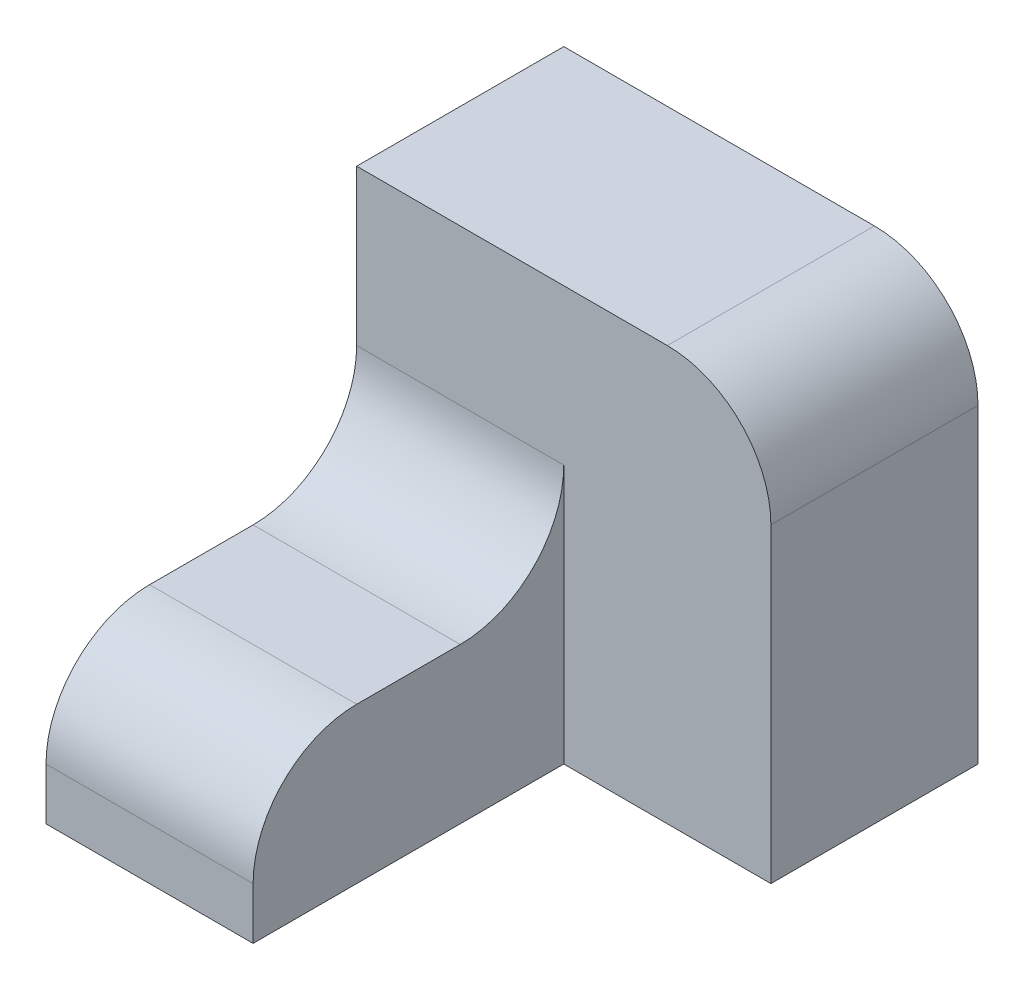
ISO-10303-21;
HEADER;
FILE_DESCRIPTION(('STEP AP214'),'2;1');
FILE_NAME('part.step','',(''),(''),'','','');
FILE_SCHEMA(('AUTOMOTIVE_DESIGN { 1 0 10303 214 1 1 1 1 }'));
ENDSEC;
DATA;
#1=APPLICATION_CONTEXT('core data for automotive mechanical design processes');
#2=APPLICATION_PROTOCOL_DEFINITION('international standard','automotive_design',2000,#1);
#3=PRODUCT_CONTEXT('',#1,'mechanical');
#4=PRODUCT('Part','Part','',(#3));
#5=PRODUCT_RELATED_PRODUCT_CATEGORY('part','',(#4));
#6=PRODUCT_DEFINITION_FORMATION('','',#4);
#7=PRODUCT_DEFINITION_CONTEXT('part definition',#1,'design');
#8=PRODUCT_DEFINITION('design','',#6,#7);
#9=PRODUCT_DEFINITION_SHAPE('','',#8);
#10=(LENGTH_UNIT() NAMED_UNIT(*) SI_UNIT(.MILLI.,.METRE.));
#11=(NAMED_UNIT(*) PLANE_ANGLE_UNIT() SI_UNIT($,.RADIAN.));
#12=(NAMED_UNIT(*) SI_UNIT($,.STERADIAN.) SOLID_ANGLE_UNIT());
#13=UNCERTAINTY_MEASURE_WITH_UNIT(LENGTH_MEASURE(1.E-05),#10,'distance_accuracy_value','');
#14=(GEOMETRIC_REPRESENTATION_CONTEXT(3) GLOBAL_UNCERTAINTY_ASSIGNED_CONTEXT((#13)) GLOBAL_UNIT_ASSIGNED_CONTEXT((#10,
#11,#12)) REPRESENTATION_CONTEXT('',''));
#15=CARTESIAN_POINT('',(0.,0.,0.));
#16=DIRECTION('',(0.,0.,1.));
#17=DIRECTION('',(1.,0.,0.));
#18=AXIS2_PLACEMENT_3D('',#15,#16,#17);
#19=CARTESIAN_POINT('',(-10.,0.,30.));
#20=DIRECTION('',(0.,-1.,0.));
#21=DIRECTION('',(1.,0.,0.));
#22=AXIS2_PLACEMENT_3D('',#19,#20,#21);
#23=PLANE('',#22);
#24=DIRECTION('',(0.,0.,-1.));
#25=VECTOR('',#24,1.);
#26=CARTESIAN_POINT('',(-10.,0.,30.));
#27=LINE('',#26,#25);
#28=CARTESIAN_POINT('',(-10.,0.,20.));
#29=VERTEX_POINT('',#28);
#30=CARTESIAN_POINT('',(-10.,0.,10.));
#31=VERTEX_POINT('',#30);
#32=EDGE_CURVE('E164',#29,#31,#27,.T.);
#33=ORIENTED_EDGE('',*,*,#32,.T.);
#34=DIRECTION('',(-1.,0.,0.));
#35=VECTOR('',#34,1.);
#36=CARTESIAN_POINT('',(-10.,0.,10.));
#37=LINE('',#36,#35);
#38=CARTESIAN_POINT('',(-30.,0.,10.));
#39=VERTEX_POINT('',#38);
#40=EDGE_CURVE('E178',#31,#39,#37,.T.);
#41=ORIENTED_EDGE('',*,*,#40,.T.);
#42=DIRECTION('',(0.,0.,-1.));
#43=VECTOR('',#42,1.);
#44=CARTESIAN_POINT('',(-30.,0.,30.));
#45=LINE('',#44,#43);
#46=CARTESIAN_POINT('',(-30.,0.,20.));
#47=VERTEX_POINT('',#46);
#48=EDGE_CURVE('E173',#47,#39,#45,.T.);
#49=ORIENTED_EDGE('',*,*,#48,.F.);
#50=DIRECTION('',(-1.,0.,0.));
#51=VECTOR('',#50,1.);
#52=CARTESIAN_POINT('',(-10.,0.,20.));
#53=LINE('',#52,#51);
#54=EDGE_CURVE('E176',#47,#29,#53,.F.);
#55=ORIENTED_EDGE('',*,*,#54,.T.);
#56=EDGE_LOOP('',(#33,#41,#49,#55));
#57=FACE_BOUND('',#56,.T.);
#58=ADVANCED_FACE('F35',(#57),#23,.F.);
#59=CARTESIAN_POINT('',(-30.,0.,30.));
#60=DIRECTION('',(1.,0.,0.));
#61=DIRECTION('',(0.,0.,-1.));
#62=AXIS2_PLACEMENT_3D('',#59,#60,#61);
#63=PLANE('',#62);
#64=DIRECTION('',(0.,-1.,0.));
#65=VECTOR('',#64,1.);
#66=CARTESIAN_POINT('',(-30.,0.,30.));
#67=LINE('',#66,#65);
#68=CARTESIAN_POINT('',(-30.,-10.,30.));
#69=VERTEX_POINT('',#68);
#70=CARTESIAN_POINT('',(-30.,-15.,30.));
#71=VERTEX_POINT('',#70);
#72=EDGE_CURVE('E158',#69,#71,#67,.T.);
#73=ORIENTED_EDGE('',*,*,#72,.F.);
#74=CARTESIAN_POINT('',(-30.,-10.,20.));
#75=DIRECTION('',(1.,0.,0.));
#76=DIRECTION('',(0.,0.,-1.));
#77=AXIS2_PLACEMENT_3D('',#74,#75,#76);
#78=CIRCLE('',#77,10.);
#79=EDGE_CURVE('E58',#69,#47,#78,.F.);
#80=ORIENTED_EDGE('',*,*,#79,.T.);
#81=ORIENTED_EDGE('',*,*,#48,.T.);
#82=CARTESIAN_POINT('',(-30.,10.,10.));
#83=DIRECTION('',(1.,0.,0.));
#84=DIRECTION('',(0.,0.,-1.));
#85=AXIS2_PLACEMENT_3D('',#82,#83,#84);
#86=CIRCLE('',#85,10.);
#87=CARTESIAN_POINT('',(-30.,10.,0.));
#88=VERTEX_POINT('',#87);
#89=EDGE_CURVE('E43',#39,#88,#86,.T.);
#90=ORIENTED_EDGE('',*,*,#89,.T.);
#91=DIRECTION('',(0.,-1.,0.));
#92=VECTOR('',#91,1.);
#93=CARTESIAN_POINT('',(-30.,25.,0.));
#94=LINE('',#93,#92);
#95=CARTESIAN_POINT('',(-30.,25.,0.));
#96=VERTEX_POINT('',#95);
#97=EDGE_CURVE('E134',#96,#88,#94,.T.);
#98=ORIENTED_EDGE('',*,*,#97,.F.);
#99=DIRECTION('',(0.,0.,1.));
#100=VECTOR('',#99,1.);
#101=CARTESIAN_POINT('',(-30.,25.,-20.));
#102=LINE('',#101,#100);
#103=CARTESIAN_POINT('',(-30.,25.,-20.));
#104=VERTEX_POINT('',#103);
#105=EDGE_CURVE('E118',#104,#96,#102,.T.);
#106=ORIENTED_EDGE('',*,*,#105,.F.);
#107=DIRECTION('',(0.,-1.,0.));
#108=VECTOR('',#107,1.);
#109=CARTESIAN_POINT('',(-30.,25.,-20.));
#110=LINE('',#109,#108);
#111=CARTESIAN_POINT('',(-30.,-15.,-20.));
#112=VERTEX_POINT('',#111);
#113=EDGE_CURVE('E125',#104,#112,#110,.T.);
#114=ORIENTED_EDGE('',*,*,#113,.T.);
#115=DIRECTION('',(0.,0.,-1.));
#116=VECTOR('',#115,1.);
#117=CARTESIAN_POINT('',(-30.,-15.,30.));
#118=LINE('',#117,#116);
#119=EDGE_CURVE('E171',#71,#112,#118,.T.);
#120=ORIENTED_EDGE('',*,*,#119,.F.);
#121=EDGE_LOOP('',(#73,#80,#81,#90,#98,#106,#114,#120));
#122=FACE_BOUND('',#121,.T.);
#123=ADVANCED_FACE('F131',(#122),#63,.F.);
#124=CARTESIAN_POINT('',(-30.,-15.,30.));
#125=DIRECTION('',(0.,1.,0.));
#126=DIRECTION('',(0.,0.,1.));
#127=AXIS2_PLACEMENT_3D('',#124,#125,#126);
#128=PLANE('',#127);
#129=ORIENTED_EDGE('',*,*,#119,.T.);
#130=DIRECTION('',(1.,0.,0.));
#131=VECTOR('',#130,1.);
#132=CARTESIAN_POINT('',(-30.,-15.,-20.));
#133=LINE('',#132,#131);
#134=CARTESIAN_POINT('',(10.,-15.,-20.));
#135=VERTEX_POINT('',#134);
#136=EDGE_CURVE('E142',#112,#135,#133,.T.);
#137=ORIENTED_EDGE('',*,*,#136,.T.);
#138=DIRECTION('',(0.,0.,1.));
#139=VECTOR('',#138,1.);
#140=CARTESIAN_POINT('',(10.,-15.,-20.));
#141=LINE('',#140,#139);
#142=CARTESIAN_POINT('',(10.,-15.,0.));
#143=VERTEX_POINT('',#142);
#144=EDGE_CURVE('E135',#135,#143,#141,.T.);
#145=ORIENTED_EDGE('',*,*,#144,.T.);
#146=DIRECTION('',(1.,0.,0.));
#147=VECTOR('',#146,1.);
#148=CARTESIAN_POINT('',(-30.,-15.,0.));
#149=LINE('',#148,#147);
#150=CARTESIAN_POINT('',(-10.,-15.,0.));
#151=VERTEX_POINT('',#150);
#152=EDGE_CURVE('E151',#151,#143,#149,.T.);
#153=ORIENTED_EDGE('',*,*,#152,.F.);
#154=DIRECTION('',(0.,0.,-1.));
#155=VECTOR('',#154,1.);
#156=CARTESIAN_POINT('',(-10.,-15.,30.));
#157=LINE('',#156,#155);
#158=CARTESIAN_POINT('',(-10.,-15.,30.));
#159=VERTEX_POINT('',#158);
#160=EDGE_CURVE('E168',#159,#151,#157,.T.);
#161=ORIENTED_EDGE('',*,*,#160,.F.);
#162=DIRECTION('',(1.,0.,0.));
#163=VECTOR('',#162,1.);
#164=CARTESIAN_POINT('',(-30.,-15.,30.));
#165=LINE('',#164,#163);
#166=EDGE_CURVE('E160',#71,#159,#165,.T.);
#167=ORIENTED_EDGE('',*,*,#166,.F.);
#168=EDGE_LOOP('',(#129,#137,#145,#153,#161,#167));
#169=FACE_BOUND('',#168,.T.);
#170=ADVANCED_FACE('F210',(#169),#128,.F.);
#171=CARTESIAN_POINT('',(-10.,-15.,30.));
#172=DIRECTION('',(-1.,0.,0.));
#173=DIRECTION('',(0.,0.,1.));
#174=AXIS2_PLACEMENT_3D('',#171,#172,#173);
#175=PLANE('',#174);
#176=ORIENTED_EDGE('',*,*,#32,.F.);
#177=CARTESIAN_POINT('',(-10.,-10.,20.));
#178=DIRECTION('',(-1.,0.,0.));
#179=DIRECTION('',(0.,0.,1.));
#180=AXIS2_PLACEMENT_3D('',#177,#178,#179);
#181=CIRCLE('',#180,10.);
#182=CARTESIAN_POINT('',(-10.,-10.,30.));
#183=VERTEX_POINT('',#182);
#184=EDGE_CURVE('E50',#29,#183,#181,.F.);
#185=ORIENTED_EDGE('',*,*,#184,.T.);
#186=DIRECTION('',(0.,1.,0.));
#187=VECTOR('',#186,1.);
#188=CARTESIAN_POINT('',(-10.,-15.,30.));
#189=LINE('',#188,#187);
#190=EDGE_CURVE('E162',#159,#183,#189,.T.);
#191=ORIENTED_EDGE('',*,*,#190,.F.);
#192=ORIENTED_EDGE('',*,*,#160,.T.);
#193=DIRECTION('',(0.,1.,0.));
#194=VECTOR('',#193,1.);
#195=CARTESIAN_POINT('',(-10.,-15.,0.));
#196=LINE('',#195,#194);
#197=CARTESIAN_POINT('',(-10.,10.,0.));
#198=VERTEX_POINT('',#197);
#199=EDGE_CURVE('E156',#151,#198,#196,.T.);
#200=ORIENTED_EDGE('',*,*,#199,.T.);
#201=CARTESIAN_POINT('',(-10.,10.,10.));
#202=DIRECTION('',(-1.,0.,0.));
#203=DIRECTION('',(0.,0.,1.));
#204=AXIS2_PLACEMENT_3D('',#201,#202,#203);
#205=CIRCLE('',#204,10.);
#206=EDGE_CURVE('E11',#198,#31,#205,.T.);
#207=ORIENTED_EDGE('',*,*,#206,.T.);
#208=EDGE_LOOP('',(#176,#185,#191,#192,#200,#207));
#209=FACE_BOUND('',#208,.T.);
#210=ADVANCED_FACE('F203',(#209),#175,.F.);
#211=CARTESIAN_POINT('',(0.,0.,30.));
#212=DIRECTION('',(0.,0.,1.));
#213=DIRECTION('',(1.,0.,0.));
#214=AXIS2_PLACEMENT_3D('',#211,#212,#213);
#215=PLANE('',#214);
#216=ORIENTED_EDGE('',*,*,#190,.T.);
#217=DIRECTION('',(-1.,0.,0.));
#218=VECTOR('',#217,1.);
#219=CARTESIAN_POINT('',(-30.,-10.,30.));
#220=LINE('',#219,#218);
#221=EDGE_CURVE('E192',#183,#69,#220,.T.);
#222=ORIENTED_EDGE('',*,*,#221,.T.);
#223=ORIENTED_EDGE('',*,*,#72,.T.);
#224=ORIENTED_EDGE('',*,*,#166,.T.);
#225=EDGE_LOOP('',(#216,#222,#223,#224));
#226=FACE_BOUND('',#225,.T.);
#227=ADVANCED_FACE('F206',(#226),#215,.T.);
#228=CARTESIAN_POINT('',(0.,0.,0.));
#229=DIRECTION('',(0.,0.,1.));
#230=DIRECTION('',(1.,0.,0.));
#231=AXIS2_PLACEMENT_3D('',#228,#229,#230);
#232=PLANE('',#231);
#233=ORIENTED_EDGE('',*,*,#97,.T.);
#234=DIRECTION('',(-1.,0.,0.));
#235=VECTOR('',#234,1.);
#236=CARTESIAN_POINT('',(0.,10.,0.));
#237=LINE('',#236,#235);
#238=EDGE_CURVE('E183',#88,#198,#237,.F.);
#239=ORIENTED_EDGE('',*,*,#238,.T.);
#240=ORIENTED_EDGE('',*,*,#199,.F.);
#241=ORIENTED_EDGE('',*,*,#152,.T.);
#242=DIRECTION('',(0.,1.,0.));
#243=VECTOR('',#242,1.);
#244=CARTESIAN_POINT('',(10.,-15.,0.));
#245=LINE('',#244,#243);
#246=CARTESIAN_POINT('',(10.,15.,0.));
#247=VERTEX_POINT('',#246);
#248=EDGE_CURVE('E126',#143,#247,#245,.T.);
#249=ORIENTED_EDGE('',*,*,#248,.T.);
#250=CARTESIAN_POINT('',(0.,15.,0.));
#251=DIRECTION('',(0.,0.,1.));
#252=DIRECTION('',(1.,0.,0.));
#253=AXIS2_PLACEMENT_3D('',#250,#251,#252);
#254=CIRCLE('',#253,10.);
#255=CARTESIAN_POINT('',(0.,25.,0.));
#256=VERTEX_POINT('',#255);
#257=EDGE_CURVE('E181',#247,#256,#254,.T.);
#258=ORIENTED_EDGE('',*,*,#257,.T.);
#259=DIRECTION('',(-1.,0.,0.));
#260=VECTOR('',#259,1.);
#261=CARTESIAN_POINT('',(10.,25.,0.));
#262=LINE('',#261,#260);
#263=EDGE_CURVE('E148',#256,#96,#262,.T.);
#264=ORIENTED_EDGE('',*,*,#263,.T.);
#265=EDGE_LOOP('',(#233,#239,#240,#241,#249,#258,#264));
#266=FACE_BOUND('',#265,.T.);
#267=ADVANCED_FACE('F200',(#266),#232,.T.);
#268=CARTESIAN_POINT('',(10.,25.,-20.));
#269=DIRECTION('',(0.,1.,0.));
#270=DIRECTION('',(-1.,0.,0.));
#271=AXIS2_PLACEMENT_3D('',#268,#269,#270);
#272=PLANE('',#271);
#273=ORIENTED_EDGE('',*,*,#263,.F.);
#274=DIRECTION('',(0.,0.,1.));
#275=VECTOR('',#274,1.);
#276=CARTESIAN_POINT('',(0.,25.,-20.));
#277=LINE('',#276,#275);
#278=CARTESIAN_POINT('',(0.,25.,-20.));
#279=VERTEX_POINT('',#278);
#280=EDGE_CURVE('E121',#256,#279,#277,.F.);
#281=ORIENTED_EDGE('',*,*,#280,.T.);
#282=DIRECTION('',(-1.,0.,0.));
#283=VECTOR('',#282,1.);
#284=CARTESIAN_POINT('',(10.,25.,-20.));
#285=LINE('',#284,#283);
#286=EDGE_CURVE('E114',#279,#104,#285,.T.);
#287=ORIENTED_EDGE('',*,*,#286,.T.);
#288=ORIENTED_EDGE('',*,*,#105,.T.);
#289=EDGE_LOOP('',(#273,#281,#287,#288));
#290=FACE_BOUND('',#289,.T.);
#291=ADVANCED_FACE('F117',(#290),#272,.T.);
#292=CARTESIAN_POINT('',(10.,-15.,-20.));
#293=DIRECTION('',(1.,0.,0.));
#294=DIRECTION('',(0.,0.,-1.));
#295=AXIS2_PLACEMENT_3D('',#292,#293,#294);
#296=PLANE('',#295);
#297=DIRECTION('',(0.,1.,0.));
#298=VECTOR('',#297,1.);
#299=CARTESIAN_POINT('',(10.,-15.,-20.));
#300=LINE('',#299,#298);
#301=CARTESIAN_POINT('',(10.,15.,-20.));
#302=VERTEX_POINT('',#301);
#303=EDGE_CURVE('E136',#135,#302,#300,.T.);
#304=ORIENTED_EDGE('',*,*,#303,.T.);
#305=DIRECTION('',(0.,0.,1.));
#306=VECTOR('',#305,1.);
#307=CARTESIAN_POINT('',(10.,15.,-20.));
#308=LINE('',#307,#306);
#309=EDGE_CURVE('E186',#302,#247,#308,.T.);
#310=ORIENTED_EDGE('',*,*,#309,.T.);
#311=ORIENTED_EDGE('',*,*,#248,.F.);
#312=ORIENTED_EDGE('',*,*,#144,.F.);
#313=EDGE_LOOP('',(#304,#310,#311,#312));
#314=FACE_BOUND('',#313,.T.);
#315=ADVANCED_FACE('F214',(#314),#296,.T.);
#316=CARTESIAN_POINT('',(0.,0.,-20.));
#317=DIRECTION('',(0.,0.,1.));
#318=DIRECTION('',(1.,0.,0.));
#319=AXIS2_PLACEMENT_3D('',#316,#317,#318);
#320=PLANE('',#319);
#321=ORIENTED_EDGE('',*,*,#286,.F.);
#322=CARTESIAN_POINT('',(0.,15.,-20.));
#323=DIRECTION('',(0.,0.,1.));
#324=DIRECTION('',(1.,0.,0.));
#325=AXIS2_PLACEMENT_3D('',#322,#323,#324);
#326=CIRCLE('',#325,10.);
#327=EDGE_CURVE('E190',#279,#302,#326,.F.);
#328=ORIENTED_EDGE('',*,*,#327,.T.);
#329=ORIENTED_EDGE('',*,*,#303,.F.);
#330=ORIENTED_EDGE('',*,*,#136,.F.);
#331=ORIENTED_EDGE('',*,*,#113,.F.);
#332=EDGE_LOOP('',(#321,#328,#329,#330,#331));
#333=FACE_BOUND('',#332,.T.);
#334=ADVANCED_FACE('F139',(#333),#320,.F.);
#335=CARTESIAN_POINT('',(-10.,10.,10.));
#336=DIRECTION('',(-1.,0.,0.));
#337=DIRECTION('',(0.,-1.,0.));
#338=AXIS2_PLACEMENT_3D('',#335,#336,#337);
#339=CYLINDRICAL_SURFACE('',#338,10.);
#340=ORIENTED_EDGE('',*,*,#206,.F.);
#341=ORIENTED_EDGE('',*,*,#238,.F.);
#342=ORIENTED_EDGE('',*,*,#89,.F.);
#343=ORIENTED_EDGE('',*,*,#40,.F.);
#344=EDGE_LOOP('',(#340,#341,#342,#343));
#345=FACE_BOUND('',#344,.T.);
#346=ADVANCED_FACE('F202',(#345),#339,.F.);
#347=CARTESIAN_POINT('',(0.,15.,-20.));
#348=DIRECTION('',(0.,0.,1.));
#349=DIRECTION('',(1.,0.,0.));
#350=AXIS2_PLACEMENT_3D('',#347,#348,#349);
#351=CYLINDRICAL_SURFACE('',#350,10.);
#352=ORIENTED_EDGE('',*,*,#327,.F.);
#353=ORIENTED_EDGE('',*,*,#280,.F.);
#354=ORIENTED_EDGE('',*,*,#257,.F.);
#355=ORIENTED_EDGE('',*,*,#309,.F.);
#356=EDGE_LOOP('',(#352,#353,#354,#355));
#357=FACE_BOUND('',#356,.T.);
#358=ADVANCED_FACE('F217',(#357),#351,.T.);
#359=CARTESIAN_POINT('',(0.,-10.,20.));
#360=DIRECTION('',(1.,0.,0.));
#361=DIRECTION('',(0.,1.,0.));
#362=AXIS2_PLACEMENT_3D('',#359,#360,#361);
#363=CYLINDRICAL_SURFACE('',#362,10.);
#364=ORIENTED_EDGE('',*,*,#184,.F.);
#365=ORIENTED_EDGE('',*,*,#54,.F.);
#366=ORIENTED_EDGE('',*,*,#79,.F.);
#367=ORIENTED_EDGE('',*,*,#221,.F.);
#368=EDGE_LOOP('',(#364,#365,#366,#367));
#369=FACE_BOUND('',#368,.T.);
#370=ADVANCED_FACE('F37',(#369),#363,.T.);
#371=CLOSED_SHELL('',(#58,#123,#170,#210,#227,#267,#291,#315,#334,#346,#358,#370));
#372=MANIFOLD_SOLID_BREP('B2',#371);
#373=ADVANCED_BREP_SHAPE_REPRESENTATION('',(#18,#372),#14);
#374=SHAPE_DEFINITION_REPRESENTATION(#9,#373);
ENDSEC;
END-ISO-10303-21;
